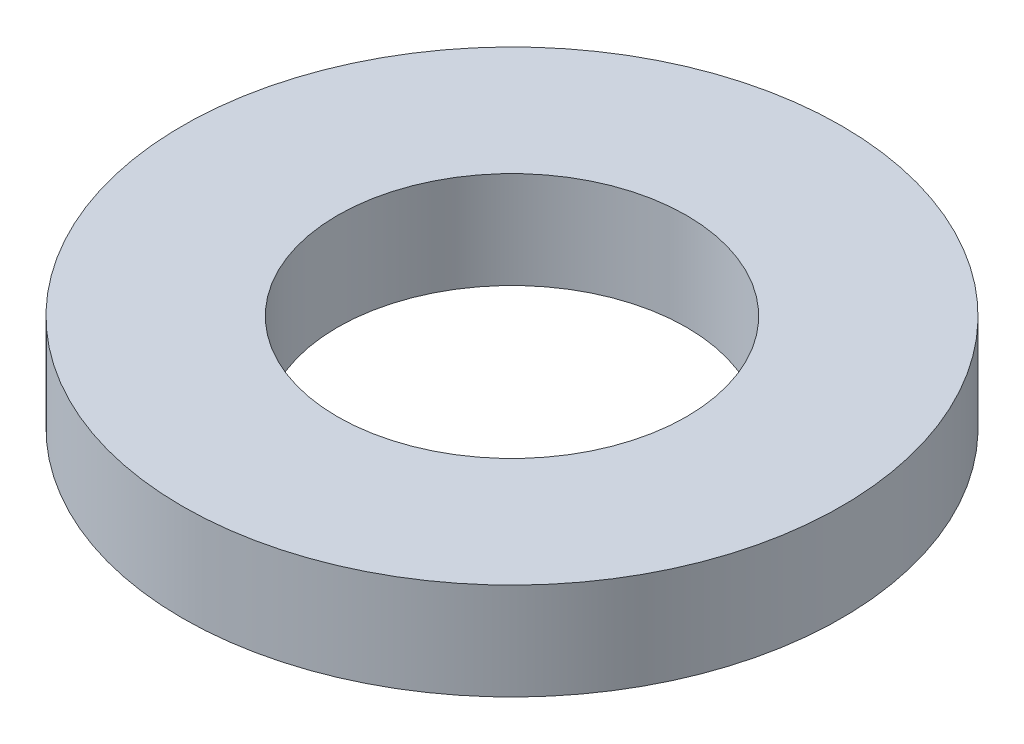
ISO-10303-21;
HEADER;
FILE_DESCRIPTION(('STEP AP214'),'2;1');
FILE_NAME('part.step','',(''),(''),'','','');
FILE_SCHEMA(('AUTOMOTIVE_DESIGN { 1 0 10303 214 1 1 1 1 }'));
ENDSEC;
DATA;
#1=APPLICATION_CONTEXT('core data for automotive mechanical design processes');
#2=APPLICATION_PROTOCOL_DEFINITION('international standard','automotive_design',2000,#1);
#3=PRODUCT_CONTEXT('',#1,'mechanical');
#4=PRODUCT('Part','Part','',(#3));
#5=PRODUCT_RELATED_PRODUCT_CATEGORY('part','',(#4));
#6=PRODUCT_DEFINITION_FORMATION('','',#4);
#7=PRODUCT_DEFINITION_CONTEXT('part definition',#1,'design');
#8=PRODUCT_DEFINITION('design','',#6,#7);
#9=PRODUCT_DEFINITION_SHAPE('','',#8);
#10=(LENGTH_UNIT() NAMED_UNIT(*) SI_UNIT(.MILLI.,.METRE.));
#11=(NAMED_UNIT(*) PLANE_ANGLE_UNIT() SI_UNIT($,.RADIAN.));
#12=(NAMED_UNIT(*) SI_UNIT($,.STERADIAN.) SOLID_ANGLE_UNIT());
#13=UNCERTAINTY_MEASURE_WITH_UNIT(LENGTH_MEASURE(1.E-05),#10,'distance_accuracy_value','');
#14=(GEOMETRIC_REPRESENTATION_CONTEXT(3) GLOBAL_UNCERTAINTY_ASSIGNED_CONTEXT((#13)) GLOBAL_UNIT_ASSIGNED_CONTEXT((#10,
#11,#12)) REPRESENTATION_CONTEXT('',''));
#15=CARTESIAN_POINT('',(0.,0.,0.));
#16=DIRECTION('',(0.,0.,1.));
#17=DIRECTION('',(1.,0.,0.));
#18=AXIS2_PLACEMENT_3D('',#15,#16,#17);
#19=CARTESIAN_POINT('',(0.,25.,0.));
#20=DIRECTION('',(0.,-1.,0.));
#21=DIRECTION('',(0.,0.,-1.));
#22=AXIS2_PLACEMENT_3D('',#19,#20,#21);
#23=CYLINDRICAL_SURFACE('',#22,85.);
#24=CARTESIAN_POINT('',(0.,25.,0.));
#25=DIRECTION('',(0.,1.,0.));
#26=DIRECTION('',(0.,0.,1.));
#27=AXIS2_PLACEMENT_3D('',#24,#25,#26);
#28=CIRCLE('',#27,85.);
#29=CARTESIAN_POINT('',(0.,25.,85.));
#30=VERTEX_POINT('',#29);
#31=EDGE_CURVE('E10',#30,#30,#28,.T.);
#32=ORIENTED_EDGE('',*,*,#31,.F.);
#33=EDGE_LOOP('',(#32));
#34=FACE_BOUND('',#33,.T.);
#35=CARTESIAN_POINT('',(0.,0.,0.));
#36=DIRECTION('',(0.,1.,0.));
#37=DIRECTION('',(0.,0.,1.));
#38=AXIS2_PLACEMENT_3D('',#35,#36,#37);
#39=CIRCLE('',#38,85.);
#40=CARTESIAN_POINT('',(0.,0.,85.));
#41=VERTEX_POINT('',#40);
#42=EDGE_CURVE('E37',#41,#41,#39,.T.);
#43=ORIENTED_EDGE('',*,*,#42,.T.);
#44=EDGE_LOOP('',(#43));
#45=FACE_BOUND('',#44,.T.);
#46=ADVANCED_FACE('F40',(#34,#45),#23,.T.);
#47=CARTESIAN_POINT('',(0.,25.,0.));
#48=DIRECTION('',(0.,1.,0.));
#49=DIRECTION('',(0.,0.,1.));
#50=AXIS2_PLACEMENT_3D('',#47,#48,#49);
#51=PLANE('',#50);
#52=CARTESIAN_POINT('',(0.,25.,0.));
#53=DIRECTION('',(0.,1.,0.));
#54=DIRECTION('',(0.,0.,1.));
#55=AXIS2_PLACEMENT_3D('',#52,#53,#54);
#56=CIRCLE('',#55,45.);
#57=CARTESIAN_POINT('',(0.,25.,45.));
#58=VERTEX_POINT('',#57);
#59=EDGE_CURVE('E50',#58,#58,#56,.T.);
#60=ORIENTED_EDGE('',*,*,#59,.F.);
#61=EDGE_LOOP('',(#60));
#62=FACE_BOUND('',#61,.T.);
#63=ORIENTED_EDGE('',*,*,#31,.T.);
#64=EDGE_LOOP('',(#63));
#65=FACE_BOUND('',#64,.T.);
#66=ADVANCED_FACE('F59',(#62,#65),#51,.T.);
#67=CARTESIAN_POINT('',(0.,0.,0.));
#68=DIRECTION('',(0.,1.,0.));
#69=DIRECTION('',(0.,0.,1.));
#70=AXIS2_PLACEMENT_3D('',#67,#68,#69);
#71=PLANE('',#70);
#72=CARTESIAN_POINT('',(0.,0.,0.));
#73=DIRECTION('',(0.,1.,0.));
#74=DIRECTION('',(0.,0.,1.));
#75=AXIS2_PLACEMENT_3D('',#72,#73,#74);
#76=CIRCLE('',#75,45.);
#77=CARTESIAN_POINT('',(0.,0.,45.));
#78=VERTEX_POINT('',#77);
#79=EDGE_CURVE('E47',#78,#78,#76,.T.);
#80=ORIENTED_EDGE('',*,*,#79,.T.);
#81=EDGE_LOOP('',(#80));
#82=FACE_BOUND('',#81,.T.);
#83=ORIENTED_EDGE('',*,*,#42,.F.);
#84=EDGE_LOOP('',(#83));
#85=FACE_BOUND('',#84,.T.);
#86=ADVANCED_FACE('F58',(#82,#85),#71,.F.);
#87=CARTESIAN_POINT('',(0.,25.,0.));
#88=DIRECTION('',(0.,-1.,0.));
#89=DIRECTION('',(0.,0.,-1.));
#90=AXIS2_PLACEMENT_3D('',#87,#88,#89);
#91=CYLINDRICAL_SURFACE('',#90,45.);
#92=ORIENTED_EDGE('',*,*,#59,.T.);
#93=EDGE_LOOP('',(#92));
#94=FACE_BOUND('',#93,.T.);
#95=ORIENTED_EDGE('',*,*,#79,.F.);
#96=EDGE_LOOP('',(#95));
#97=FACE_BOUND('',#96,.T.);
#98=ADVANCED_FACE('F54',(#94,#97),#91,.F.);
#99=CLOSED_SHELL('',(#46,#66,#86,#98));
#100=MANIFOLD_SOLID_BREP('B2',#99);
#101=ADVANCED_BREP_SHAPE_REPRESENTATION('',(#18,#100),#14);
#102=SHAPE_DEFINITION_REPRESENTATION(#9,#101);
ENDSEC;
END-ISO-10303-21;
